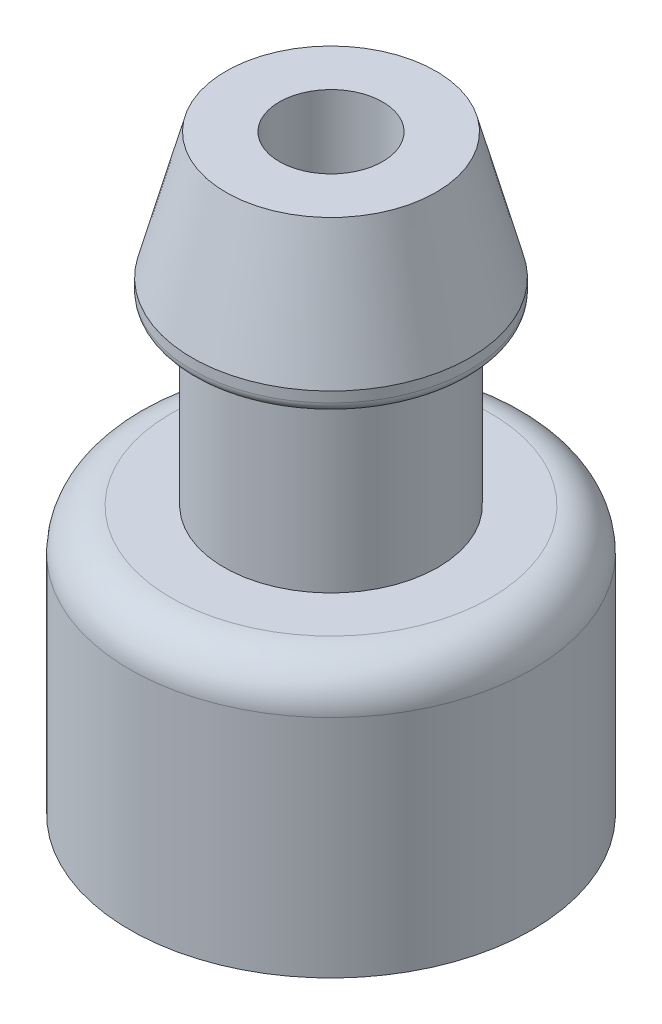
ISO-10303-21;
HEADER;
FILE_DESCRIPTION(('STEP AP214'),'2;1');
FILE_NAME('part.step','',(''),(''),'','','');
FILE_SCHEMA(('AUTOMOTIVE_DESIGN { 1 0 10303 214 1 1 1 1 }'));
ENDSEC;
DATA;
#1=APPLICATION_CONTEXT('core data for automotive mechanical design processes');
#2=APPLICATION_PROTOCOL_DEFINITION('international standard','automotive_design',2000,#1);
#3=PRODUCT_CONTEXT('',#1,'mechanical');
#4=PRODUCT('Part','Part','',(#3));
#5=PRODUCT_RELATED_PRODUCT_CATEGORY('part','',(#4));
#6=PRODUCT_DEFINITION_FORMATION('','',#4);
#7=PRODUCT_DEFINITION_CONTEXT('part definition',#1,'design');
#8=PRODUCT_DEFINITION('design','',#6,#7);
#9=PRODUCT_DEFINITION_SHAPE('','',#8);
#10=(LENGTH_UNIT() NAMED_UNIT(*) SI_UNIT(.MILLI.,.METRE.));
#11=(NAMED_UNIT(*) PLANE_ANGLE_UNIT() SI_UNIT($,.RADIAN.));
#12=(NAMED_UNIT(*) SI_UNIT($,.STERADIAN.) SOLID_ANGLE_UNIT());
#13=UNCERTAINTY_MEASURE_WITH_UNIT(LENGTH_MEASURE(1.E-05),#10,'distance_accuracy_value','');
#14=(GEOMETRIC_REPRESENTATION_CONTEXT(3) GLOBAL_UNCERTAINTY_ASSIGNED_CONTEXT((#13)) GLOBAL_UNIT_ASSIGNED_CONTEXT((#10,
#11,#12)) REPRESENTATION_CONTEXT('',''));
#15=CARTESIAN_POINT('',(0.,0.,0.));
#16=DIRECTION('',(0.,0.,1.));
#17=DIRECTION('',(1.,0.,0.));
#18=AXIS2_PLACEMENT_3D('',#15,#16,#17);
#19=CARTESIAN_POINT('',(2.5,25.1953317633222,0.));
#20=DIRECTION('',(0.,1.,0.));
#21=DIRECTION('',(-1.,0.,0.));
#22=AXIS2_PLACEMENT_3D('',#19,#20,#21);
#23=PLANE('',#22);
#24=CARTESIAN_POINT('',(0.,25.1953317633222,0.));
#25=DIRECTION('',(0.,1.,0.));
#26=DIRECTION('',(-1.,0.,0.));
#27=AXIS2_PLACEMENT_3D('',#24,#25,#26);
#28=CIRCLE('',#27,2.49999999999999);
#29=CARTESIAN_POINT('',(-2.49999999999998,25.1953317633222,0.));
#30=VERTEX_POINT('',#29);
#31=EDGE_CURVE('E156',#30,#30,#28,.F.);
#32=ORIENTED_EDGE('',*,*,#31,.T.);
#33=EDGE_LOOP('',(#32));
#34=FACE_BOUND('',#33,.T.);
#35=CARTESIAN_POINT('',(0.,25.1953317632569,0.));
#36=DIRECTION('',(0.,-1.,0.));
#37=DIRECTION('',(1.,0.,0.));
#38=AXIS2_PLACEMENT_3D('',#35,#36,#37);
#39=CIRCLE('',#38,5.07999999999447);
#40=CARTESIAN_POINT('',(5.07999999999449,25.1953317632569,0.));
#41=VERTEX_POINT('',#40);
#42=EDGE_CURVE('E171',#41,#41,#39,.T.);
#43=ORIENTED_EDGE('',*,*,#42,.F.);
#44=EDGE_LOOP('',(#43));
#45=FACE_BOUND('',#44,.T.);
#46=ADVANCED_FACE('F16',(#34,#45),#23,.T.);
#47=CARTESIAN_POINT('',(0.,19.0833317633974,0.));
#48=DIRECTION('',(0.,-1.,0.));
#49=DIRECTION('',(1.,0.,0.));
#50=AXIS2_PLACEMENT_3D('',#47,#48,#49);
#51=CONICAL_SURFACE('',#50,6.71887128058301,0.261977344231248);
#52=ORIENTED_EDGE('',*,*,#42,.T.);
#53=EDGE_LOOP('',(#52));
#54=FACE_BOUND('',#53,.T.);
#55=CARTESIAN_POINT('',(0.,19.0833317633222,0.));
#56=DIRECTION('',(0.,1.,0.));
#57=DIRECTION('',(-1.,0.,0.));
#58=AXIS2_PLACEMENT_3D('',#55,#56,#57);
#59=CIRCLE('',#58,6.71887128061717);
#60=CARTESIAN_POINT('',(-6.71887128061716,19.0833317633222,0.));
#61=VERTEX_POINT('',#60);
#62=EDGE_CURVE('E153',#61,#61,#59,.F.);
#63=ORIENTED_EDGE('',*,*,#62,.F.);
#64=EDGE_LOOP('',(#63));
#65=FACE_BOUND('',#64,.T.);
#66=ADVANCED_FACE('F297',(#54,#65),#51,.T.);
#67=CARTESIAN_POINT('',(0.,0.,0.));
#68=DIRECTION('',(0.,1.,0.));
#69=DIRECTION('',(-1.,0.,0.));
#70=AXIS2_PLACEMENT_3D('',#67,#68,#69);
#71=CYLINDRICAL_SURFACE('',#70,2.49999999999999);
#72=ORIENTED_EDGE('',*,*,#31,.F.);
#73=EDGE_LOOP('',(#72));
#74=FACE_BOUND('',#73,.T.);
#75=CARTESIAN_POINT('',(0.,7.53433182332216,0.));
#76=DIRECTION('',(0.,1.,0.));
#77=DIRECTION('',(-1.,0.,0.));
#78=AXIS2_PLACEMENT_3D('',#75,#76,#77);
#79=CIRCLE('',#78,2.49999999999999);
#80=CARTESIAN_POINT('',(-2.49999999999999,7.53433182332216,0.));
#81=VERTEX_POINT('',#80);
#82=EDGE_CURVE('E152',#81,#81,#79,.T.);
#83=ORIENTED_EDGE('',*,*,#82,.F.);
#84=EDGE_LOOP('',(#83));
#85=FACE_BOUND('',#84,.T.);
#86=ADVANCED_FACE('F295',(#74,#85),#71,.F.);
#87=CARTESIAN_POINT('',(0.,0.,0.));
#88=DIRECTION('',(0.,1.,0.));
#89=DIRECTION('',(-1.,0.,0.));
#90=AXIS2_PLACEMENT_3D('',#87,#88,#89);
#91=CYLINDRICAL_SURFACE('',#90,6.71887128061717);
#92=CARTESIAN_POINT('',(0.,18.5833317633222,0.));
#93=DIRECTION('',(0.,1.,0.));
#94=DIRECTION('',(-1.,0.,0.));
#95=AXIS2_PLACEMENT_3D('',#92,#93,#94);
#96=CIRCLE('',#95,6.71887128061717);
#97=CARTESIAN_POINT('',(-6.71887128061716,18.5833317633222,0.));
#98=VERTEX_POINT('',#97);
#99=EDGE_CURVE('E143',#98,#98,#96,.F.);
#100=ORIENTED_EDGE('',*,*,#99,.F.);
#101=EDGE_LOOP('',(#100));
#102=FACE_BOUND('',#101,.T.);
#103=ORIENTED_EDGE('',*,*,#62,.T.);
#104=EDGE_LOOP('',(#103));
#105=FACE_BOUND('',#104,.T.);
#106=ADVANCED_FACE('F128',(#102,#105),#91,.T.);
#107=CARTESIAN_POINT('',(5.65,7.53433182332216,0.));
#108=DIRECTION('',(0.,-1.,0.));
#109=DIRECTION('',(1.,0.,0.));
#110=AXIS2_PLACEMENT_3D('',#107,#108,#109);
#111=PLANE('',#110);
#112=CARTESIAN_POINT('',(0.,7.53433182332216,0.));
#113=DIRECTION('',(0.,1.,0.));
#114=DIRECTION('',(-1.,0.,0.));
#115=AXIS2_PLACEMENT_3D('',#112,#113,#114);
#116=CIRCLE('',#115,5.65);
#117=CARTESIAN_POINT('',(5.65,7.53433182332216,0.));
#118=VERTEX_POINT('',#117);
#119=CARTESIAN_POINT('',(-5.64999999999999,7.53433182332216,0.));
#120=VERTEX_POINT('',#119);
#121=EDGE_CURVE('E64',#118,#120,#116,.F.);
#122=ORIENTED_EDGE('',*,*,#121,.T.);
#123=CARTESIAN_POINT('',(0.,7.53433182332216,0.));
#124=DIRECTION('',(0.,1.,0.));
#125=DIRECTION('',(1.,0.,0.));
#126=AXIS2_PLACEMENT_3D('',#123,#124,#125);
#127=CIRCLE('',#126,5.65);
#128=EDGE_CURVE('E151',#120,#118,#127,.F.);
#129=ORIENTED_EDGE('',*,*,#128,.T.);
#130=EDGE_LOOP('',(#122,#129));
#131=FACE_BOUND('',#130,.T.);
#132=ORIENTED_EDGE('',*,*,#82,.T.);
#133=EDGE_LOOP('',(#132));
#134=FACE_BOUND('',#133,.T.);
#135=ADVANCED_FACE('F119',(#131,#134),#111,.T.);
#136=CARTESIAN_POINT('',(0.,18.5833317633222,0.));
#137=DIRECTION('',(0.,1.,0.));
#138=DIRECTION('',(-1.,0.,0.));
#139=AXIS2_PLACEMENT_3D('',#136,#137,#138);
#140=TOROIDAL_SURFACE('',#139,6.21887128061717,0.500000000000001);
#141=CARTESIAN_POINT('',(0.,18.0833317633222,0.));
#142=DIRECTION('',(0.,1.,0.));
#143=DIRECTION('',(-1.,0.,0.));
#144=AXIS2_PLACEMENT_3D('',#141,#142,#143);
#145=CIRCLE('',#144,6.21887128061717);
#146=CARTESIAN_POINT('',(6.21887128061718,18.0833317633222,0.));
#147=VERTEX_POINT('',#146);
#148=CARTESIAN_POINT('',(-6.21887128061716,18.0833317633222,0.));
#149=VERTEX_POINT('',#148);
#150=EDGE_CURVE('E59',#147,#149,#145,.F.);
#151=ORIENTED_EDGE('',*,*,#150,.F.);
#152=CARTESIAN_POINT('',(0.,18.0833317633222,0.));
#153=DIRECTION('',(0.,1.,0.));
#154=DIRECTION('',(1.,0.,0.));
#155=AXIS2_PLACEMENT_3D('',#152,#153,#154);
#156=CIRCLE('',#155,6.21887128061717);
#157=EDGE_CURVE('E56',#149,#147,#156,.F.);
#158=ORIENTED_EDGE('',*,*,#157,.F.);
#159=EDGE_LOOP('',(#151,#158));
#160=FACE_BOUND('',#159,.T.);
#161=ORIENTED_EDGE('',*,*,#99,.T.);
#162=EDGE_LOOP('',(#161));
#163=FACE_BOUND('',#162,.T.);
#164=ADVANCED_FACE('F60',(#160,#163),#140,.T.);
#165=CARTESIAN_POINT('',(0.,7.03433182332216,0.));
#166=DIRECTION('',(0.,1.,0.));
#167=DIRECTION('',(-1.,0.,0.));
#168=AXIS2_PLACEMENT_3D('',#165,#166,#167);
#169=TOROIDAL_SURFACE('',#168,5.65,0.500000000000001);
#170=CARTESIAN_POINT('',(0.,7.03433182332216,0.));
#171=DIRECTION('',(0.,1.,0.));
#172=DIRECTION('',(-1.,0.,0.));
#173=AXIS2_PLACEMENT_3D('',#170,#171,#172);
#174=CIRCLE('',#173,6.15);
#175=CARTESIAN_POINT('',(-6.15,7.03433182332216,0.));
#176=VERTEX_POINT('',#175);
#177=EDGE_CURVE('E69',#176,#176,#174,.F.);
#178=ORIENTED_EDGE('',*,*,#177,.T.);
#179=EDGE_LOOP('',(#178));
#180=FACE_BOUND('',#179,.T.);
#181=ORIENTED_EDGE('',*,*,#128,.F.);
#182=ORIENTED_EDGE('',*,*,#121,.F.);
#183=EDGE_LOOP('',(#181,#182));
#184=FACE_BOUND('',#183,.T.);
#185=ADVANCED_FACE('F89',(#180,#184),#169,.F.);
#186=CARTESIAN_POINT('',(6.21887128061718,18.0833317633222,0.));
#187=DIRECTION('',(0.,-1.,0.));
#188=DIRECTION('',(1.,0.,0.));
#189=AXIS2_PLACEMENT_3D('',#186,#187,#188);
#190=PLANE('',#189);
#191=ORIENTED_EDGE('',*,*,#150,.T.);
#192=ORIENTED_EDGE('',*,*,#157,.T.);
#193=EDGE_LOOP('',(#191,#192));
#194=FACE_BOUND('',#193,.T.);
#195=CARTESIAN_POINT('',(0.,18.0833317633222,0.));
#196=DIRECTION('',(0.,1.,0.));
#197=DIRECTION('',(-1.,0.,0.));
#198=AXIS2_PLACEMENT_3D('',#195,#196,#197);
#199=CIRCLE('',#198,5.17499999999999);
#200=CARTESIAN_POINT('',(-5.17499999999998,18.0833317633222,0.));
#201=VERTEX_POINT('',#200);
#202=EDGE_CURVE('E164',#201,#201,#199,.F.);
#203=ORIENTED_EDGE('',*,*,#202,.F.);
#204=EDGE_LOOP('',(#203));
#205=FACE_BOUND('',#204,.T.);
#206=ADVANCED_FACE('F67',(#194,#205),#190,.T.);
#207=CARTESIAN_POINT('',(0.,0.,0.));
#208=DIRECTION('',(0.,1.,0.));
#209=DIRECTION('',(-1.,0.,0.));
#210=AXIS2_PLACEMENT_3D('',#207,#208,#209);
#211=CYLINDRICAL_SURFACE('',#210,6.15);
#212=CARTESIAN_POINT('',(0.,-0.833668176677837,0.));
#213=DIRECTION('',(0.,-1.,0.));
#214=DIRECTION('',(1.,0.,0.));
#215=AXIS2_PLACEMENT_3D('',#212,#213,#214);
#216=CIRCLE('',#215,6.15);
#217=CARTESIAN_POINT('',(6.15,-0.83366817667784,0.));
#218=VERTEX_POINT('',#217);
#219=EDGE_CURVE('E163',#218,#218,#216,.F.);
#220=ORIENTED_EDGE('',*,*,#219,.F.);
#221=EDGE_LOOP('',(#220));
#222=FACE_BOUND('',#221,.T.);
#223=ORIENTED_EDGE('',*,*,#177,.F.);
#224=EDGE_LOOP('',(#223));
#225=FACE_BOUND('',#224,.T.);
#226=ADVANCED_FACE('F88',(#222,#225),#211,.F.);
#227=CARTESIAN_POINT('',(0.,0.,0.));
#228=DIRECTION('',(0.,1.,0.));
#229=DIRECTION('',(-1.,0.,0.));
#230=AXIS2_PLACEMENT_3D('',#227,#228,#229);
#231=CYLINDRICAL_SURFACE('',#230,5.17499999999999);
#232=CARTESIAN_POINT('',(0.,9.53433182332216,0.));
#233=DIRECTION('',(0.,1.,0.));
#234=DIRECTION('',(-1.,0.,0.));
#235=AXIS2_PLACEMENT_3D('',#232,#233,#234);
#236=CIRCLE('',#235,5.17499999999999);
#237=CARTESIAN_POINT('',(-5.17499999999999,9.53433182332216,0.));
#238=VERTEX_POINT('',#237);
#239=EDGE_CURVE('E160',#238,#238,#236,.F.);
#240=ORIENTED_EDGE('',*,*,#239,.F.);
#241=EDGE_LOOP('',(#240));
#242=FACE_BOUND('',#241,.T.);
#243=ORIENTED_EDGE('',*,*,#202,.T.);
#244=EDGE_LOOP('',(#243));
#245=FACE_BOUND('',#244,.T.);
#246=ADVANCED_FACE('F274',(#242,#245),#231,.T.);
#247=CARTESIAN_POINT('',(0.,-0.833668176677836,0.));
#248=DIRECTION('',(0.,-1.,0.));
#249=DIRECTION('',(1.,0.,0.));
#250=AXIS2_PLACEMENT_3D('',#247,#248,#249);
#251=TOROIDAL_SURFACE('',#250,8.69,2.54);
#252=ORIENTED_EDGE('',*,*,#219,.T.);
#253=EDGE_LOOP('',(#252));
#254=FACE_BOUND('',#253,.T.);
#255=CARTESIAN_POINT('',(0.,-3.37366817667784,0.));
#256=DIRECTION('',(0.,-1.,0.));
#257=DIRECTION('',(1.,0.,0.));
#258=AXIS2_PLACEMENT_3D('',#255,#256,#257);
#259=CIRCLE('',#258,8.69);
#260=CARTESIAN_POINT('',(-8.69,-3.37366817667783,0.));
#261=VERTEX_POINT('',#260);
#262=CARTESIAN_POINT('',(8.69,-3.37366817667784,0.));
#263=VERTEX_POINT('',#262);
#264=EDGE_CURVE('E214',#261,#263,#259,.F.);
#265=ORIENTED_EDGE('',*,*,#264,.F.);
#266=CARTESIAN_POINT('',(0.,-3.37366817667784,0.));
#267=DIRECTION('',(0.,-1.,0.));
#268=DIRECTION('',(-1.,0.,0.));
#269=AXIS2_PLACEMENT_3D('',#266,#267,#268);
#270=CIRCLE('',#269,8.69);
#271=EDGE_CURVE('E204',#263,#261,#270,.F.);
#272=ORIENTED_EDGE('',*,*,#271,.F.);
#273=EDGE_LOOP('',(#265,#272));
#274=FACE_BOUND('',#273,.T.);
#275=ADVANCED_FACE('F236',(#254,#274),#251,.T.);
#276=CARTESIAN_POINT('',(5.175,9.53433182332216,0.));
#277=DIRECTION('',(0.,1.,0.));
#278=DIRECTION('',(-1.,0.,0.));
#279=AXIS2_PLACEMENT_3D('',#276,#277,#278);
#280=PLANE('',#279);
#281=ORIENTED_EDGE('',*,*,#239,.T.);
#282=EDGE_LOOP('',(#281));
#283=FACE_BOUND('',#282,.T.);
#284=CARTESIAN_POINT('',(0.,9.53433182332216,0.));
#285=DIRECTION('',(0.,-1.,0.));
#286=DIRECTION('',(1.,0.,0.));
#287=AXIS2_PLACEMENT_3D('',#284,#285,#286);
#288=CIRCLE('',#287,7.72819999999999);
#289=CARTESIAN_POINT('',(7.7282,9.53433182332216,0.));
#290=VERTEX_POINT('',#289);
#291=CARTESIAN_POINT('',(-7.72819999999999,9.53433182332216,0.));
#292=VERTEX_POINT('',#291);
#293=EDGE_CURVE('E159',#290,#292,#288,.T.);
#294=ORIENTED_EDGE('',*,*,#293,.F.);
#295=CARTESIAN_POINT('',(0.,9.53433182332216,0.));
#296=DIRECTION('',(0.,-1.,0.));
#297=DIRECTION('',(-1.,0.,0.));
#298=AXIS2_PLACEMENT_3D('',#295,#296,#297);
#299=CIRCLE('',#298,7.72819999999999);
#300=EDGE_CURVE('E35',#292,#290,#299,.T.);
#301=ORIENTED_EDGE('',*,*,#300,.F.);
#302=EDGE_LOOP('',(#294,#301));
#303=FACE_BOUND('',#302,.T.);
#304=ADVANCED_FACE('F227',(#283,#303),#280,.T.);
#305=CARTESIAN_POINT('',(9.72819999999999,-3.37366817667784,0.));
#306=DIRECTION('',(0.,-1.,0.));
#307=DIRECTION('',(1.,0.,0.));
#308=AXIS2_PLACEMENT_3D('',#305,#306,#307);
#309=PLANE('',#308);
#310=CARTESIAN_POINT('',(0.,-3.37366817667784,0.));
#311=DIRECTION('',(0.,1.,0.));
#312=DIRECTION('',(-1.,0.,0.));
#313=AXIS2_PLACEMENT_3D('',#310,#311,#312);
#314=CIRCLE('',#313,9.7282);
#315=CARTESIAN_POINT('',(-9.7282,-3.37366817667783,0.));
#316=VERTEX_POINT('',#315);
#317=EDGE_CURVE('E27',#316,#316,#314,.T.);
#318=ORIENTED_EDGE('',*,*,#317,.F.);
#319=EDGE_LOOP('',(#318));
#320=FACE_BOUND('',#319,.T.);
#321=ORIENTED_EDGE('',*,*,#271,.T.);
#322=ORIENTED_EDGE('',*,*,#264,.T.);
#323=EDGE_LOOP('',(#321,#322));
#324=FACE_BOUND('',#323,.T.);
#325=ADVANCED_FACE('F193',(#320,#324),#309,.T.);
#326=CARTESIAN_POINT('',(0.,7.53433182332216,0.));
#327=DIRECTION('',(0.,1.,0.));
#328=DIRECTION('',(-1.,0.,0.));
#329=AXIS2_PLACEMENT_3D('',#326,#327,#328);
#330=TOROIDAL_SURFACE('',#329,7.72819999999999,2.);
#331=ORIENTED_EDGE('',*,*,#300,.T.);
#332=ORIENTED_EDGE('',*,*,#293,.T.);
#333=EDGE_LOOP('',(#331,#332));
#334=FACE_BOUND('',#333,.T.);
#335=CARTESIAN_POINT('',(0.,7.53433182332216,0.));
#336=DIRECTION('',(0.,1.,0.));
#337=DIRECTION('',(-1.,0.,0.));
#338=AXIS2_PLACEMENT_3D('',#335,#336,#337);
#339=CIRCLE('',#338,9.7282);
#340=CARTESIAN_POINT('',(-9.72819999999999,7.53433182332217,0.));
#341=VERTEX_POINT('',#340);
#342=EDGE_CURVE('E11',#341,#341,#339,.F.);
#343=ORIENTED_EDGE('',*,*,#342,.F.);
#344=EDGE_LOOP('',(#343));
#345=FACE_BOUND('',#344,.T.);
#346=ADVANCED_FACE('F181',(#334,#345),#330,.T.);
#347=CARTESIAN_POINT('',(0.,0.,0.));
#348=DIRECTION('',(0.,1.,0.));
#349=DIRECTION('',(-1.,0.,0.));
#350=AXIS2_PLACEMENT_3D('',#347,#348,#349);
#351=CYLINDRICAL_SURFACE('',#350,9.7282);
#352=ORIENTED_EDGE('',*,*,#342,.T.);
#353=EDGE_LOOP('',(#352));
#354=FACE_BOUND('',#353,.T.);
#355=ORIENTED_EDGE('',*,*,#317,.T.);
#356=EDGE_LOOP('',(#355));
#357=FACE_BOUND('',#356,.T.);
#358=ADVANCED_FACE('F192',(#354,#357),#351,.T.);
#359=CLOSED_SHELL('',(#46,#66,#86,#106,#135,#164,#185,#206,#226,#246,#275,#304,#325,#346,#358));
#360=MANIFOLD_SOLID_BREP('B1',#359);
#361=ADVANCED_BREP_SHAPE_REPRESENTATION('',(#18,#360),#14);
#362=SHAPE_DEFINITION_REPRESENTATION(#9,#361);
ENDSEC;
END-ISO-10303-21;
